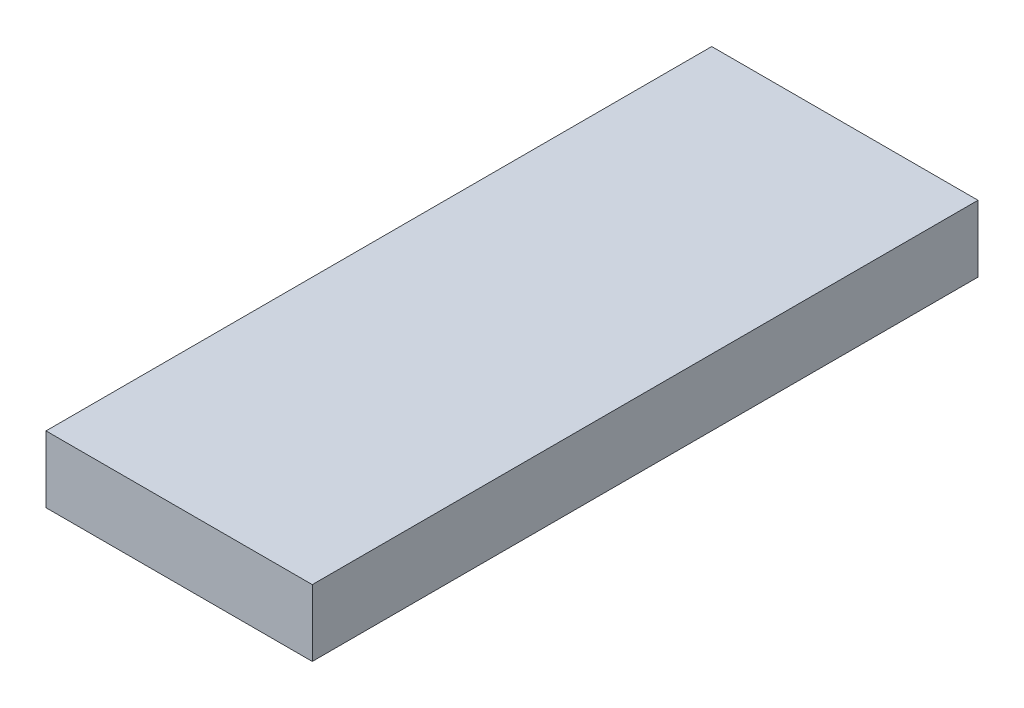
ISO-10303-21;
HEADER;
FILE_DESCRIPTION(('STEP AP214'),'2;1');
FILE_NAME('part.step','',(''),(''),'','','');
FILE_SCHEMA(('AUTOMOTIVE_DESIGN { 1 0 10303 214 1 1 1 1 }'));
ENDSEC;
DATA;
#1=APPLICATION_CONTEXT('core data for automotive mechanical design processes');
#2=APPLICATION_PROTOCOL_DEFINITION('international standard','automotive_design',2000,#1);
#3=PRODUCT_CONTEXT('',#1,'mechanical');
#4=PRODUCT('Part','Part','',(#3));
#5=PRODUCT_RELATED_PRODUCT_CATEGORY('part','',(#4));
#6=PRODUCT_DEFINITION_FORMATION('','',#4);
#7=PRODUCT_DEFINITION_CONTEXT('part definition',#1,'design');
#8=PRODUCT_DEFINITION('design','',#6,#7);
#9=PRODUCT_DEFINITION_SHAPE('','',#8);
#10=(LENGTH_UNIT() NAMED_UNIT(*) SI_UNIT(.MILLI.,.METRE.));
#11=(NAMED_UNIT(*) PLANE_ANGLE_UNIT() SI_UNIT($,.RADIAN.));
#12=(NAMED_UNIT(*) SI_UNIT($,.STERADIAN.) SOLID_ANGLE_UNIT());
#13=UNCERTAINTY_MEASURE_WITH_UNIT(LENGTH_MEASURE(1.E-05),#10,'distance_accuracy_value','');
#14=(GEOMETRIC_REPRESENTATION_CONTEXT(3) GLOBAL_UNCERTAINTY_ASSIGNED_CONTEXT((#13)) GLOBAL_UNIT_ASSIGNED_CONTEXT((#10,
#11,#12)) REPRESENTATION_CONTEXT('',''));
#15=CARTESIAN_POINT('',(0.,0.,0.));
#16=DIRECTION('',(0.,0.,1.));
#17=DIRECTION('',(1.,0.,0.));
#18=AXIS2_PLACEMENT_3D('',#15,#16,#17);
#19=CARTESIAN_POINT('',(-20.,10.,-50.));
#20=DIRECTION('',(1.,0.,0.));
#21=DIRECTION('',(0.,0.,-1.));
#22=AXIS2_PLACEMENT_3D('',#19,#20,#21);
#23=PLANE('',#22);
#24=DIRECTION('',(0.,0.,1.));
#25=VECTOR('',#24,1.);
#26=CARTESIAN_POINT('',(-20.,0.,-50.));
#27=LINE('',#26,#25);
#28=CARTESIAN_POINT('',(-20.,0.,-50.));
#29=VERTEX_POINT('',#28);
#30=CARTESIAN_POINT('',(-20.,0.,50.));
#31=VERTEX_POINT('',#30);
#32=EDGE_CURVE('E96',#29,#31,#27,.T.);
#33=ORIENTED_EDGE('',*,*,#32,.T.);
#34=DIRECTION('',(0.,-1.,0.));
#35=VECTOR('',#34,1.);
#36=CARTESIAN_POINT('',(-20.,10.,50.));
#37=LINE('',#36,#35);
#38=CARTESIAN_POINT('',(-20.,10.,50.));
#39=VERTEX_POINT('',#38);
#40=EDGE_CURVE('E11',#39,#31,#37,.T.);
#41=ORIENTED_EDGE('',*,*,#40,.F.);
#42=DIRECTION('',(0.,0.,1.));
#43=VECTOR('',#42,1.);
#44=CARTESIAN_POINT('',(-20.,10.,-50.));
#45=LINE('',#44,#43);
#46=CARTESIAN_POINT('',(-20.,10.,-50.));
#47=VERTEX_POINT('',#46);
#48=EDGE_CURVE('E84',#47,#39,#45,.T.);
#49=ORIENTED_EDGE('',*,*,#48,.F.);
#50=DIRECTION('',(0.,-1.,0.));
#51=VECTOR('',#50,1.);
#52=CARTESIAN_POINT('',(-20.,10.,-50.));
#53=LINE('',#52,#51);
#54=EDGE_CURVE('E92',#47,#29,#53,.T.);
#55=ORIENTED_EDGE('',*,*,#54,.T.);
#56=EDGE_LOOP('',(#33,#41,#49,#55));
#57=FACE_BOUND('',#56,.T.);
#58=ADVANCED_FACE('F33',(#57),#23,.F.);
#59=CARTESIAN_POINT('',(-20.,10.,50.));
#60=DIRECTION('',(0.,0.,-1.));
#61=DIRECTION('',(-1.,0.,0.));
#62=AXIS2_PLACEMENT_3D('',#59,#60,#61);
#63=PLANE('',#62);
#64=DIRECTION('',(1.,0.,0.));
#65=VECTOR('',#64,1.);
#66=CARTESIAN_POINT('',(-20.,0.,50.));
#67=LINE('',#66,#65);
#68=CARTESIAN_POINT('',(20.,0.,50.));
#69=VERTEX_POINT('',#68);
#70=EDGE_CURVE('E88',#31,#69,#67,.T.);
#71=ORIENTED_EDGE('',*,*,#70,.T.);
#72=DIRECTION('',(0.,-1.,0.));
#73=VECTOR('',#72,1.);
#74=CARTESIAN_POINT('',(20.,10.,50.));
#75=LINE('',#74,#73);
#76=CARTESIAN_POINT('',(20.,10.,50.));
#77=VERTEX_POINT('',#76);
#78=EDGE_CURVE('E41',#77,#69,#75,.T.);
#79=ORIENTED_EDGE('',*,*,#78,.F.);
#80=DIRECTION('',(1.,0.,0.));
#81=VECTOR('',#80,1.);
#82=CARTESIAN_POINT('',(-20.,10.,50.));
#83=LINE('',#82,#81);
#84=EDGE_CURVE('E79',#39,#77,#83,.T.);
#85=ORIENTED_EDGE('',*,*,#84,.F.);
#86=ORIENTED_EDGE('',*,*,#40,.T.);
#87=EDGE_LOOP('',(#71,#79,#85,#86));
#88=FACE_BOUND('',#87,.T.);
#89=ADVANCED_FACE('F87',(#88),#63,.F.);
#90=CARTESIAN_POINT('',(20.,10.,-50.));
#91=DIRECTION('',(-1.,0.,0.));
#92=DIRECTION('',(0.,0.,1.));
#93=AXIS2_PLACEMENT_3D('',#90,#91,#92);
#94=PLANE('',#93);
#95=DIRECTION('',(0.,0.,-1.));
#96=VECTOR('',#95,1.);
#97=CARTESIAN_POINT('',(20.,0.,-50.));
#98=LINE('',#97,#96);
#99=CARTESIAN_POINT('',(20.,0.,-50.));
#100=VERTEX_POINT('',#99);
#101=EDGE_CURVE('E66',#69,#100,#98,.T.);
#102=ORIENTED_EDGE('',*,*,#101,.T.);
#103=DIRECTION('',(0.,-1.,0.));
#104=VECTOR('',#103,1.);
#105=CARTESIAN_POINT('',(20.,10.,-50.));
#106=LINE('',#105,#104);
#107=CARTESIAN_POINT('',(20.,10.,-50.));
#108=VERTEX_POINT('',#107);
#109=EDGE_CURVE('E89',#108,#100,#106,.T.);
#110=ORIENTED_EDGE('',*,*,#109,.F.);
#111=DIRECTION('',(0.,0.,-1.));
#112=VECTOR('',#111,1.);
#113=CARTESIAN_POINT('',(20.,10.,-50.));
#114=LINE('',#113,#112);
#115=EDGE_CURVE('E82',#77,#108,#114,.T.);
#116=ORIENTED_EDGE('',*,*,#115,.F.);
#117=ORIENTED_EDGE('',*,*,#78,.T.);
#118=EDGE_LOOP('',(#102,#110,#116,#117));
#119=FACE_BOUND('',#118,.T.);
#120=ADVANCED_FACE('F90',(#119),#94,.F.);
#121=CARTESIAN_POINT('',(-20.,10.,-50.));
#122=DIRECTION('',(0.,0.,1.));
#123=DIRECTION('',(1.,0.,0.));
#124=AXIS2_PLACEMENT_3D('',#121,#122,#123);
#125=PLANE('',#124);
#126=DIRECTION('',(-1.,0.,0.));
#127=VECTOR('',#126,1.);
#128=CARTESIAN_POINT('',(-20.,0.,-50.));
#129=LINE('',#128,#127);
#130=EDGE_CURVE('E72',#100,#29,#129,.T.);
#131=ORIENTED_EDGE('',*,*,#130,.T.);
#132=ORIENTED_EDGE('',*,*,#54,.F.);
#133=DIRECTION('',(-1.,0.,0.));
#134=VECTOR('',#133,1.);
#135=CARTESIAN_POINT('',(-20.,10.,-50.));
#136=LINE('',#135,#134);
#137=EDGE_CURVE('E49',#108,#47,#136,.T.);
#138=ORIENTED_EDGE('',*,*,#137,.F.);
#139=ORIENTED_EDGE('',*,*,#109,.T.);
#140=EDGE_LOOP('',(#131,#132,#138,#139));
#141=FACE_BOUND('',#140,.T.);
#142=ADVANCED_FACE('F103',(#141),#125,.F.);
#143=CARTESIAN_POINT('',(0.,10.,0.));
#144=DIRECTION('',(0.,1.,0.));
#145=DIRECTION('',(0.,0.,1.));
#146=AXIS2_PLACEMENT_3D('',#143,#144,#145);
#147=PLANE('',#146);
#148=ORIENTED_EDGE('',*,*,#48,.T.);
#149=ORIENTED_EDGE('',*,*,#84,.T.);
#150=ORIENTED_EDGE('',*,*,#115,.T.);
#151=ORIENTED_EDGE('',*,*,#137,.T.);
#152=EDGE_LOOP('',(#148,#149,#150,#151));
#153=FACE_BOUND('',#152,.T.);
#154=ADVANCED_FACE('F80',(#153),#147,.T.);
#155=CARTESIAN_POINT('',(0.,0.,0.));
#156=DIRECTION('',(0.,1.,0.));
#157=DIRECTION('',(0.,0.,1.));
#158=AXIS2_PLACEMENT_3D('',#155,#156,#157);
#159=PLANE('',#158);
#160=ORIENTED_EDGE('',*,*,#32,.F.);
#161=ORIENTED_EDGE('',*,*,#130,.F.);
#162=ORIENTED_EDGE('',*,*,#101,.F.);
#163=ORIENTED_EDGE('',*,*,#70,.F.);
#164=EDGE_LOOP('',(#160,#161,#162,#163));
#165=FACE_BOUND('',#164,.T.);
#166=ADVANCED_FACE('F106',(#165),#159,.F.);
#167=CLOSED_SHELL('',(#58,#89,#120,#142,#154,#166));
#168=MANIFOLD_SOLID_BREP('B2',#167);
#169=ADVANCED_BREP_SHAPE_REPRESENTATION('',(#18,#168),#14);
#170=SHAPE_DEFINITION_REPRESENTATION(#9,#169);
ENDSEC;
END-ISO-10303-21;
